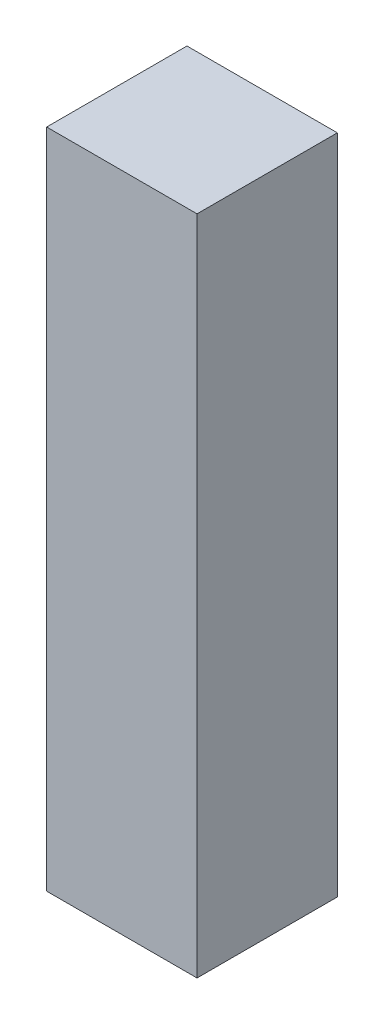
ISO-10303-21;
HEADER;
FILE_DESCRIPTION(('STEP AP214'),'2;1');
FILE_NAME('part.step','',(''),(''),'','','');
FILE_SCHEMA(('AUTOMOTIVE_DESIGN { 1 0 10303 214 1 1 1 1 }'));
ENDSEC;
DATA;
#1=APPLICATION_CONTEXT('core data for automotive mechanical design processes');
#2=APPLICATION_PROTOCOL_DEFINITION('international standard','automotive_design',2000,#1);
#3=PRODUCT_CONTEXT('',#1,'mechanical');
#4=PRODUCT('Part','Part','',(#3));
#5=PRODUCT_RELATED_PRODUCT_CATEGORY('part','',(#4));
#6=PRODUCT_DEFINITION_FORMATION('','',#4);
#7=PRODUCT_DEFINITION_CONTEXT('part definition',#1,'design');
#8=PRODUCT_DEFINITION('design','',#6,#7);
#9=PRODUCT_DEFINITION_SHAPE('','',#8);
#10=(LENGTH_UNIT() NAMED_UNIT(*) SI_UNIT(.MILLI.,.METRE.));
#11=(NAMED_UNIT(*) PLANE_ANGLE_UNIT() SI_UNIT($,.RADIAN.));
#12=(NAMED_UNIT(*) SI_UNIT($,.STERADIAN.) SOLID_ANGLE_UNIT());
#13=UNCERTAINTY_MEASURE_WITH_UNIT(LENGTH_MEASURE(1.E-05),#10,'distance_accuracy_value','');
#14=(GEOMETRIC_REPRESENTATION_CONTEXT(3) GLOBAL_UNCERTAINTY_ASSIGNED_CONTEXT((#13)) GLOBAL_UNIT_ASSIGNED_CONTEXT((#10,
#11,#12)) REPRESENTATION_CONTEXT('',''));
#15=CARTESIAN_POINT('',(0.,0.,0.));
#16=DIRECTION('',(0.,0.,1.));
#17=DIRECTION('',(1.,0.,0.));
#18=AXIS2_PLACEMENT_3D('',#15,#16,#17);
#19=CARTESIAN_POINT('',(0.,1.269999991302E-06,0.71000112));
#20=DIRECTION('',(0.,0.,-1.));
#21=DIRECTION('',(-1.,0.,0.));
#22=AXIS2_PLACEMENT_3D('',#19,#20,#21);
#23=PLANE('',#22);
#24=DIRECTION('',(0.,1.,0.));
#25=VECTOR('',#24,1.);
#26=CARTESIAN_POINT('',(0.380492,1.67449246,0.71000112));
#27=LINE('',#26,#25);
#28=CARTESIAN_POINT('',(0.380492,1.67449246,0.71000112));
#29=VERTEX_POINT('',#28);
#30=CARTESIAN_POINT('',(0.380492,-1.67448992,0.71000112));
#31=VERTEX_POINT('',#30);
#32=EDGE_CURVE('E69',#29,#31,#27,.F.);
#33=ORIENTED_EDGE('',*,*,#32,.F.);
#34=DIRECTION('',(1.,0.,0.));
#35=VECTOR('',#34,1.);
#36=CARTESIAN_POINT('',(-0.380492,1.67449246,0.71000112));
#37=LINE('',#36,#35);
#38=CARTESIAN_POINT('',(-0.380492,1.67449246,0.71000112));
#39=VERTEX_POINT('',#38);
#40=EDGE_CURVE('E56',#39,#29,#37,.T.);
#41=ORIENTED_EDGE('',*,*,#40,.F.);
#42=DIRECTION('',(0.,1.,0.));
#43=VECTOR('',#42,1.);
#44=CARTESIAN_POINT('',(-0.380492,-1.67448992,0.71000112));
#45=LINE('',#44,#43);
#46=CARTESIAN_POINT('',(-0.380492,-1.67448992,0.71000112));
#47=VERTEX_POINT('',#46);
#48=EDGE_CURVE('E62',#47,#39,#45,.T.);
#49=ORIENTED_EDGE('',*,*,#48,.F.);
#50=DIRECTION('',(-1.,0.,0.));
#51=VECTOR('',#50,1.);
#52=CARTESIAN_POINT('',(0.,-1.67448992,0.71000112));
#53=LINE('',#52,#51);
#54=EDGE_CURVE('E20',#31,#47,#53,.T.);
#55=ORIENTED_EDGE('',*,*,#54,.F.);
#56=EDGE_LOOP('',(#33,#41,#49,#55));
#57=FACE_BOUND('',#56,.T.);
#58=ADVANCED_FACE('F17',(#57),#23,.F.);
#59=CARTESIAN_POINT('',(-0.380492,-1.67448992,0.));
#60=DIRECTION('',(-1.,0.,0.));
#61=DIRECTION('',(0.,0.,1.));
#62=AXIS2_PLACEMENT_3D('',#59,#60,#61);
#63=PLANE('',#62);
#64=DIRECTION('',(0.,0.,1.));
#65=VECTOR('',#64,1.);
#66=CARTESIAN_POINT('',(-0.380492,1.67449246,0.));
#67=LINE('',#66,#65);
#68=CARTESIAN_POINT('',(-0.380492,1.67449246,0.));
#69=VERTEX_POINT('',#68);
#70=EDGE_CURVE('E64',#69,#39,#67,.T.);
#71=ORIENTED_EDGE('',*,*,#70,.F.);
#72=DIRECTION('',(0.,1.,0.));
#73=VECTOR('',#72,1.);
#74=CARTESIAN_POINT('',(-0.380492,1.269999991302E-06,0.));
#75=LINE('',#74,#73);
#76=CARTESIAN_POINT('',(-0.380492,-1.67448992,0.));
#77=VERTEX_POINT('',#76);
#78=EDGE_CURVE('E83',#77,#69,#75,.T.);
#79=ORIENTED_EDGE('',*,*,#78,.F.);
#80=DIRECTION('',(0.,0.,-1.));
#81=VECTOR('',#80,1.);
#82=CARTESIAN_POINT('',(-0.380492,-1.67448992,0.));
#83=LINE('',#82,#81);
#84=EDGE_CURVE('E67',#47,#77,#83,.T.);
#85=ORIENTED_EDGE('',*,*,#84,.F.);
#86=ORIENTED_EDGE('',*,*,#48,.T.);
#87=EDGE_LOOP('',(#71,#79,#85,#86));
#88=FACE_BOUND('',#87,.T.);
#89=ADVANCED_FACE('F63',(#88),#63,.T.);
#90=CARTESIAN_POINT('',(-0.380492,1.67449246,0.));
#91=DIRECTION('',(0.,1.,0.));
#92=DIRECTION('',(0.,0.,1.));
#93=AXIS2_PLACEMENT_3D('',#90,#91,#92);
#94=PLANE('',#93);
#95=DIRECTION('',(0.,0.,-1.));
#96=VECTOR('',#95,1.);
#97=CARTESIAN_POINT('',(0.380492,1.67449246,0.));
#98=LINE('',#97,#96);
#99=CARTESIAN_POINT('',(0.380492,1.67449246,0.));
#100=VERTEX_POINT('',#99);
#101=EDGE_CURVE('E71',#100,#29,#98,.F.);
#102=ORIENTED_EDGE('',*,*,#101,.F.);
#103=DIRECTION('',(-1.,0.,0.));
#104=VECTOR('',#103,1.);
#105=CARTESIAN_POINT('',(0.,1.67449246,0.));
#106=LINE('',#105,#104);
#107=EDGE_CURVE('E75',#69,#100,#106,.F.);
#108=ORIENTED_EDGE('',*,*,#107,.F.);
#109=ORIENTED_EDGE('',*,*,#70,.T.);
#110=ORIENTED_EDGE('',*,*,#40,.T.);
#111=EDGE_LOOP('',(#102,#108,#109,#110));
#112=FACE_BOUND('',#111,.T.);
#113=ADVANCED_FACE('F73',(#112),#94,.T.);
#114=CARTESIAN_POINT('',(0.380492,1.67449246,0.));
#115=DIRECTION('',(1.,0.,0.));
#116=DIRECTION('',(0.,0.,-1.));
#117=AXIS2_PLACEMENT_3D('',#114,#115,#116);
#118=PLANE('',#117);
#119=DIRECTION('',(0.,0.,-1.));
#120=VECTOR('',#119,1.);
#121=CARTESIAN_POINT('',(0.380492,-1.67448992,0.));
#122=LINE('',#121,#120);
#123=CARTESIAN_POINT('',(0.380492,-1.67448992,0.));
#124=VERTEX_POINT('',#123);
#125=EDGE_CURVE('E35',#124,#31,#122,.F.);
#126=ORIENTED_EDGE('',*,*,#125,.F.);
#127=DIRECTION('',(0.,1.,0.));
#128=VECTOR('',#127,1.);
#129=CARTESIAN_POINT('',(0.380492,1.269999991302E-06,0.));
#130=LINE('',#129,#128);
#131=EDGE_CURVE('E26',#100,#124,#130,.F.);
#132=ORIENTED_EDGE('',*,*,#131,.F.);
#133=ORIENTED_EDGE('',*,*,#101,.T.);
#134=ORIENTED_EDGE('',*,*,#32,.T.);
#135=EDGE_LOOP('',(#126,#132,#133,#134));
#136=FACE_BOUND('',#135,.T.);
#137=ADVANCED_FACE('F89',(#136),#118,.T.);
#138=CARTESIAN_POINT('',(0.380492,-1.67448992,0.));
#139=DIRECTION('',(0.,-1.,0.));
#140=DIRECTION('',(0.,0.,-1.));
#141=AXIS2_PLACEMENT_3D('',#138,#139,#140);
#142=PLANE('',#141);
#143=ORIENTED_EDGE('',*,*,#84,.T.);
#144=DIRECTION('',(-1.,0.,0.));
#145=VECTOR('',#144,1.);
#146=CARTESIAN_POINT('',(0.,-1.67448992,0.));
#147=LINE('',#146,#145);
#148=EDGE_CURVE('E11',#124,#77,#147,.T.);
#149=ORIENTED_EDGE('',*,*,#148,.F.);
#150=ORIENTED_EDGE('',*,*,#125,.T.);
#151=ORIENTED_EDGE('',*,*,#54,.T.);
#152=EDGE_LOOP('',(#143,#149,#150,#151));
#153=FACE_BOUND('',#152,.T.);
#154=ADVANCED_FACE('F91',(#153),#142,.T.);
#155=CARTESIAN_POINT('',(0.,1.269999991302E-06,0.));
#156=DIRECTION('',(0.,0.,-1.));
#157=DIRECTION('',(-1.,0.,0.));
#158=AXIS2_PLACEMENT_3D('',#155,#156,#157);
#159=PLANE('',#158);
#160=ORIENTED_EDGE('',*,*,#131,.T.);
#161=ORIENTED_EDGE('',*,*,#148,.T.);
#162=ORIENTED_EDGE('',*,*,#78,.T.);
#163=ORIENTED_EDGE('',*,*,#107,.T.);
#164=EDGE_LOOP('',(#160,#161,#162,#163));
#165=FACE_BOUND('',#164,.T.);
#166=ADVANCED_FACE('F88',(#165),#159,.T.);
#167=CLOSED_SHELL('',(#58,#89,#113,#137,#154,#166));
#168=MANIFOLD_SOLID_BREP('B1',#167);
#169=ADVANCED_BREP_SHAPE_REPRESENTATION('',(#18,#168),#14);
#170=SHAPE_DEFINITION_REPRESENTATION(#9,#169);
ENDSEC;
END-ISO-10303-21;
